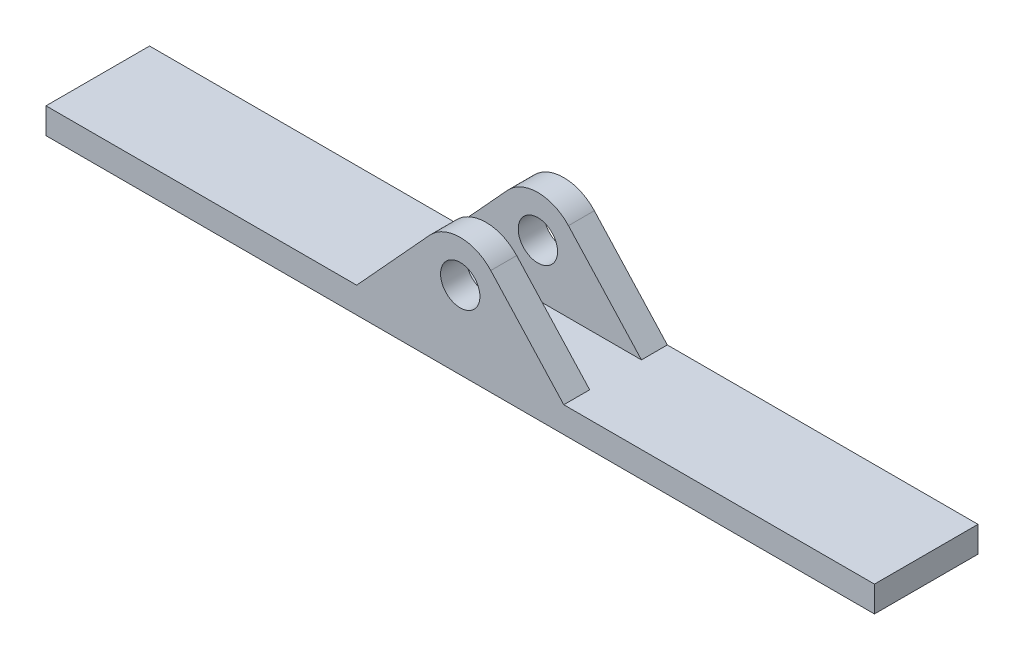
ISO-10303-21;
HEADER;
FILE_DESCRIPTION(('STEP AP214'),'2;1');
FILE_NAME('part.step','',(''),(''),'','','');
FILE_SCHEMA(('AUTOMOTIVE_DESIGN { 1 0 10303 214 1 1 1 1 }'));
ENDSEC;
DATA;
#1=APPLICATION_CONTEXT('core data for automotive mechanical design processes');
#2=APPLICATION_PROTOCOL_DEFINITION('international standard','automotive_design',2000,#1);
#3=PRODUCT_CONTEXT('',#1,'mechanical');
#4=PRODUCT('Part','Part','',(#3));
#5=PRODUCT_RELATED_PRODUCT_CATEGORY('part','',(#4));
#6=PRODUCT_DEFINITION_FORMATION('','',#4);
#7=PRODUCT_DEFINITION_CONTEXT('part definition',#1,'design');
#8=PRODUCT_DEFINITION('design','',#6,#7);
#9=PRODUCT_DEFINITION_SHAPE('','',#8);
#10=(LENGTH_UNIT() NAMED_UNIT(*) SI_UNIT(.MILLI.,.METRE.));
#11=(NAMED_UNIT(*) PLANE_ANGLE_UNIT() SI_UNIT($,.RADIAN.));
#12=(NAMED_UNIT(*) SI_UNIT($,.STERADIAN.) SOLID_ANGLE_UNIT());
#13=UNCERTAINTY_MEASURE_WITH_UNIT(LENGTH_MEASURE(1.E-05),#10,'distance_accuracy_value','');
#14=(GEOMETRIC_REPRESENTATION_CONTEXT(3) GLOBAL_UNCERTAINTY_ASSIGNED_CONTEXT((#13)) GLOBAL_UNIT_ASSIGNED_CONTEXT((#10,
#11,#12)) REPRESENTATION_CONTEXT('',''));
#15=CARTESIAN_POINT('',(0.,0.,0.));
#16=DIRECTION('',(0.,0.,1.));
#17=DIRECTION('',(1.,0.,0.));
#18=AXIS2_PLACEMENT_3D('',#15,#16,#17);
#19=CARTESIAN_POINT('',(-50.8,-6.34999999999978,0.));
#20=DIRECTION('',(0.,0.,1.));
#21=DIRECTION('',(1.,0.,0.));
#22=AXIS2_PLACEMENT_3D('',#19,#20,#21);
#23=PLANE('',#22);
#24=CARTESIAN_POINT('',(0.,0.,0.));
#25=DIRECTION('',(0.,0.,1.));
#26=DIRECTION('',(1.,0.,0.));
#27=AXIS2_PLACEMENT_3D('',#24,#25,#26);
#28=CIRCLE('',#27,2.413);
#29=CARTESIAN_POINT('',(2.413,0.,0.));
#30=VERTEX_POINT('',#29);
#31=EDGE_CURVE('E119',#30,#30,#28,.T.);
#32=ORIENTED_EDGE('',*,*,#31,.T.);
#33=EDGE_LOOP('',(#32));
#34=FACE_BOUND('',#33,.T.);
#35=CARTESIAN_POINT('',(0.,0.,0.));
#36=DIRECTION('',(0.,0.,1.));
#37=DIRECTION('',(1.,0.,0.));
#38=AXIS2_PLACEMENT_3D('',#35,#36,#37);
#39=CIRCLE('',#38,5.08);
#40=CARTESIAN_POINT('',(3.74707028261062,3.43014056522125,0.));
#41=VERTEX_POINT('',#40);
#42=CARTESIAN_POINT('',(-3.74707028261063,3.43014056522125,0.));
#43=VERTEX_POINT('',#42);
#44=EDGE_CURVE('E19',#41,#43,#39,.T.);
#45=ORIENTED_EDGE('',*,*,#44,.F.);
#46=DIRECTION('',(-0.675224520712844,0.737612260356422,0.));
#47=VECTOR('',#46,1.);
#48=CARTESIAN_POINT('',(0.,7.52342346015067,0.));
#49=LINE('',#48,#47);
#50=CARTESIAN_POINT('',(12.7,-6.35,0.));
#51=VERTEX_POINT('',#50);
#52=EDGE_CURVE('E112',#51,#41,#49,.T.);
#53=ORIENTED_EDGE('',*,*,#52,.F.);
#54=DIRECTION('',(-1.,0.,0.));
#55=VECTOR('',#54,1.);
#56=CARTESIAN_POINT('',(12.7,-6.35,0.));
#57=LINE('',#56,#55);
#58=CARTESIAN_POINT('',(-12.7,-6.34999999999995,0.));
#59=VERTEX_POINT('',#58);
#60=EDGE_CURVE('E116',#59,#51,#57,.F.);
#61=ORIENTED_EDGE('',*,*,#60,.F.);
#62=DIRECTION('',(-0.675224520712844,-0.737612260356422,0.));
#63=VECTOR('',#62,1.);
#64=CARTESIAN_POINT('',(-12.7,-6.35,0.));
#65=LINE('',#64,#63);
#66=EDGE_CURVE('E114',#43,#59,#65,.T.);
#67=ORIENTED_EDGE('',*,*,#66,.F.);
#68=EDGE_LOOP('',(#45,#53,#61,#67));
#69=FACE_BOUND('',#68,.T.);
#70=ADVANCED_FACE('F16',(#34,#69),#23,.F.);
#71=CARTESIAN_POINT('',(-50.8,-6.34999999999978,-6.35));
#72=DIRECTION('',(0.,0.,-1.));
#73=DIRECTION('',(-1.,0.,0.));
#74=AXIS2_PLACEMENT_3D('',#71,#72,#73);
#75=PLANE('',#74);
#76=CARTESIAN_POINT('',(0.,0.,-6.35));
#77=DIRECTION('',(0.,0.,1.));
#78=DIRECTION('',(1.,0.,0.));
#79=AXIS2_PLACEMENT_3D('',#76,#77,#78);
#80=CIRCLE('',#79,2.413);
#81=CARTESIAN_POINT('',(2.413,0.,-6.35));
#82=VERTEX_POINT('',#81);
#83=EDGE_CURVE('E153',#82,#82,#80,.F.);
#84=ORIENTED_EDGE('',*,*,#83,.T.);
#85=EDGE_LOOP('',(#84));
#86=FACE_BOUND('',#85,.T.);
#87=CARTESIAN_POINT('',(0.,0.,-6.35));
#88=DIRECTION('',(0.,0.,1.));
#89=DIRECTION('',(1.,0.,0.));
#90=AXIS2_PLACEMENT_3D('',#87,#88,#89);
#91=CIRCLE('',#90,5.08);
#92=CARTESIAN_POINT('',(-3.74707028261063,3.43014056522125,-6.35));
#93=VERTEX_POINT('',#92);
#94=CARTESIAN_POINT('',(3.74707028261063,3.43014056522124,-6.35));
#95=VERTEX_POINT('',#94);
#96=EDGE_CURVE('E191',#93,#95,#91,.F.);
#97=ORIENTED_EDGE('',*,*,#96,.F.);
#98=DIRECTION('',(-0.675224520712844,-0.737612260356422,0.));
#99=VECTOR('',#98,1.);
#100=CARTESIAN_POINT('',(-12.7,-6.35,-6.35));
#101=LINE('',#100,#99);
#102=CARTESIAN_POINT('',(-12.7,-6.35,-6.35));
#103=VERTEX_POINT('',#102);
#104=EDGE_CURVE('E156',#103,#93,#101,.F.);
#105=ORIENTED_EDGE('',*,*,#104,.F.);
#106=DIRECTION('',(-1.,0.,0.));
#107=VECTOR('',#106,1.);
#108=CARTESIAN_POINT('',(12.7,-6.35,-6.35));
#109=LINE('',#108,#107);
#110=CARTESIAN_POINT('',(12.7,-6.34999999999997,-6.35));
#111=VERTEX_POINT('',#110);
#112=EDGE_CURVE('E149',#111,#103,#109,.T.);
#113=ORIENTED_EDGE('',*,*,#112,.F.);
#114=DIRECTION('',(-0.675224520712844,0.737612260356422,0.));
#115=VECTOR('',#114,1.);
#116=CARTESIAN_POINT('',(0.,7.52342346015067,-6.35));
#117=LINE('',#116,#115);
#118=EDGE_CURVE('E134',#95,#111,#117,.F.);
#119=ORIENTED_EDGE('',*,*,#118,.F.);
#120=EDGE_LOOP('',(#97,#105,#113,#119));
#121=FACE_BOUND('',#120,.T.);
#122=ADVANCED_FACE('F342',(#86,#121),#75,.F.);
#123=CARTESIAN_POINT('',(0.,7.52342346015067,-9.525));
#124=DIRECTION('',(0.737612260356422,0.675224520712844,0.));
#125=DIRECTION('',(-0.675224520712844,0.737612260356422,0.));
#126=AXIS2_PLACEMENT_3D('',#123,#124,#125);
#127=PLANE('',#126);
#128=DIRECTION('',(-0.675224520712844,0.737612260356422,0.));
#129=VECTOR('',#128,1.);
#130=CARTESIAN_POINT('',(12.7,-6.35,3.175));
#131=LINE('',#130,#129);
#132=CARTESIAN_POINT('',(12.7,-6.35,3.175));
#133=VERTEX_POINT('',#132);
#134=CARTESIAN_POINT('',(3.74707028261063,3.43014056522124,3.175));
#135=VERTEX_POINT('',#134);
#136=EDGE_CURVE('E190',#133,#135,#131,.T.);
#137=ORIENTED_EDGE('',*,*,#136,.F.);
#138=DIRECTION('',(0.,0.,1.));
#139=VECTOR('',#138,1.);
#140=CARTESIAN_POINT('',(12.7,-6.35,-9.525));
#141=LINE('',#140,#139);
#142=EDGE_CURVE('E131',#51,#133,#141,.T.);
#143=ORIENTED_EDGE('',*,*,#142,.F.);
#144=ORIENTED_EDGE('',*,*,#52,.T.);
#145=DIRECTION('',(0.,0.,1.));
#146=VECTOR('',#145,1.);
#147=CARTESIAN_POINT('',(3.74707028261062,3.43014056522125,-9.525));
#148=LINE('',#147,#146);
#149=EDGE_CURVE('E111',#135,#41,#148,.F.);
#150=ORIENTED_EDGE('',*,*,#149,.F.);
#151=EDGE_LOOP('',(#137,#143,#144,#150));
#152=FACE_BOUND('',#151,.T.);
#153=ADVANCED_FACE('F340',(#152),#127,.T.);
#154=CARTESIAN_POINT('',(0.,0.,-9.525));
#155=DIRECTION('',(0.,0.,1.));
#156=DIRECTION('',(1.,0.,0.));
#157=AXIS2_PLACEMENT_3D('',#154,#155,#156);
#158=CYLINDRICAL_SURFACE('',#157,5.08);
#159=CARTESIAN_POINT('',(0.,0.,3.175));
#160=DIRECTION('',(0.,0.,1.));
#161=DIRECTION('',(1.,0.,0.));
#162=AXIS2_PLACEMENT_3D('',#159,#160,#161);
#163=CIRCLE('',#162,5.08);
#164=CARTESIAN_POINT('',(-3.74707028261063,3.43014056522125,3.175));
#165=VERTEX_POINT('',#164);
#166=EDGE_CURVE('E188',#135,#165,#163,.T.);
#167=ORIENTED_EDGE('',*,*,#166,.F.);
#168=ORIENTED_EDGE('',*,*,#149,.T.);
#169=ORIENTED_EDGE('',*,*,#44,.T.);
#170=DIRECTION('',(0.,0.,1.));
#171=VECTOR('',#170,1.);
#172=CARTESIAN_POINT('',(-3.74707028261062,3.43014056522125,-9.525));
#173=LINE('',#172,#171);
#174=EDGE_CURVE('E109',#165,#43,#173,.F.);
#175=ORIENTED_EDGE('',*,*,#174,.F.);
#176=EDGE_LOOP('',(#167,#168,#169,#175));
#177=FACE_BOUND('',#176,.T.);
#178=ADVANCED_FACE('F107',(#177),#158,.T.);
#179=CARTESIAN_POINT('',(-12.7,-6.35,-9.525));
#180=DIRECTION('',(-0.737612260356422,0.675224520712844,0.));
#181=DIRECTION('',(-0.675224520712844,-0.737612260356422,0.));
#182=AXIS2_PLACEMENT_3D('',#179,#180,#181);
#183=PLANE('',#182);
#184=ORIENTED_EDGE('',*,*,#66,.T.);
#185=DIRECTION('',(0.,0.,1.));
#186=VECTOR('',#185,1.);
#187=CARTESIAN_POINT('',(-12.7,-6.34999999999999,-9.525));
#188=LINE('',#187,#186);
#189=CARTESIAN_POINT('',(-12.7,-6.35,3.175));
#190=VERTEX_POINT('',#189);
#191=EDGE_CURVE('E152',#190,#59,#188,.F.);
#192=ORIENTED_EDGE('',*,*,#191,.F.);
#193=DIRECTION('',(-0.675224520712844,-0.737612260356422,0.));
#194=VECTOR('',#193,1.);
#195=CARTESIAN_POINT('',(-3.74707028261062,3.43014056522125,3.175));
#196=LINE('',#195,#194);
#197=EDGE_CURVE('E123',#165,#190,#196,.T.);
#198=ORIENTED_EDGE('',*,*,#197,.F.);
#199=ORIENTED_EDGE('',*,*,#174,.T.);
#200=EDGE_LOOP('',(#184,#192,#198,#199));
#201=FACE_BOUND('',#200,.T.);
#202=ADVANCED_FACE('F121',(#201),#183,.T.);
#203=CARTESIAN_POINT('',(0.,0.,-9.525));
#204=DIRECTION('',(0.,0.,1.));
#205=DIRECTION('',(1.,0.,0.));
#206=AXIS2_PLACEMENT_3D('',#203,#204,#205);
#207=CYLINDRICAL_SURFACE('',#206,2.413);
#208=CARTESIAN_POINT('',(0.,0.,3.175));
#209=DIRECTION('',(0.,0.,1.));
#210=DIRECTION('',(1.,0.,0.));
#211=AXIS2_PLACEMENT_3D('',#208,#209,#210);
#212=CIRCLE('',#211,2.413);
#213=CARTESIAN_POINT('',(2.413,0.,3.175));
#214=VERTEX_POINT('',#213);
#215=EDGE_CURVE('E140',#214,#214,#212,.F.);
#216=ORIENTED_EDGE('',*,*,#215,.F.);
#217=EDGE_LOOP('',(#216));
#218=FACE_BOUND('',#217,.T.);
#219=ORIENTED_EDGE('',*,*,#31,.F.);
#220=EDGE_LOOP('',(#219));
#221=FACE_BOUND('',#220,.T.);
#222=ADVANCED_FACE('F199',(#218,#221),#207,.F.);
#223=CARTESIAN_POINT('',(0.,0.,-9.525));
#224=DIRECTION('',(0.,0.,1.));
#225=DIRECTION('',(1.,0.,0.));
#226=AXIS2_PLACEMENT_3D('',#223,#224,#225);
#227=CYLINDRICAL_SURFACE('',#226,2.413);
#228=CARTESIAN_POINT('',(0.,0.,-9.525));
#229=DIRECTION('',(0.,0.,1.));
#230=DIRECTION('',(1.,0.,0.));
#231=AXIS2_PLACEMENT_3D('',#228,#229,#230);
#232=CIRCLE('',#231,2.413);
#233=CARTESIAN_POINT('',(2.413,0.,-9.525));
#234=VERTEX_POINT('',#233);
#235=EDGE_CURVE('E180',#234,#234,#232,.F.);
#236=ORIENTED_EDGE('',*,*,#235,.T.);
#237=EDGE_LOOP('',(#236));
#238=FACE_BOUND('',#237,.T.);
#239=ORIENTED_EDGE('',*,*,#83,.F.);
#240=EDGE_LOOP('',(#239));
#241=FACE_BOUND('',#240,.T.);
#242=ADVANCED_FACE('F201',(#238,#241),#227,.F.);
#243=CARTESIAN_POINT('',(12.7,-6.35,-9.525));
#244=DIRECTION('',(0.,1.,0.));
#245=DIRECTION('',(-1.,0.,0.));
#246=AXIS2_PLACEMENT_3D('',#243,#244,#245);
#247=PLANE('',#246);
#248=DIRECTION('',(0.,0.,1.));
#249=VECTOR('',#248,1.);
#250=CARTESIAN_POINT('',(50.8,-6.35,-9.525));
#251=LINE('',#250,#249);
#252=CARTESIAN_POINT('',(50.8,-6.35,-9.525));
#253=VERTEX_POINT('',#252);
#254=CARTESIAN_POINT('',(50.8,-6.35,3.175));
#255=VERTEX_POINT('',#254);
#256=EDGE_CURVE('E254',#253,#255,#251,.T.);
#257=ORIENTED_EDGE('',*,*,#256,.F.);
#258=DIRECTION('',(1.,0.,0.));
#259=VECTOR('',#258,1.);
#260=CARTESIAN_POINT('',(0.,-6.35,-9.525));
#261=LINE('',#260,#259);
#262=CARTESIAN_POINT('',(12.7,-6.34999999999999,-9.525));
#263=VERTEX_POINT('',#262);
#264=EDGE_CURVE('E258',#253,#263,#261,.F.);
#265=ORIENTED_EDGE('',*,*,#264,.T.);
#266=DIRECTION('',(0.,0.,1.));
#267=VECTOR('',#266,1.);
#268=CARTESIAN_POINT('',(12.7,-6.34999999999996,-9.525));
#269=LINE('',#268,#267);
#270=EDGE_CURVE('E165',#111,#263,#269,.F.);
#271=ORIENTED_EDGE('',*,*,#270,.F.);
#272=ORIENTED_EDGE('',*,*,#112,.T.);
#273=DIRECTION('',(0.,0.,1.));
#274=VECTOR('',#273,1.);
#275=CARTESIAN_POINT('',(-12.7,-6.35,-9.525));
#276=LINE('',#275,#274);
#277=CARTESIAN_POINT('',(-12.7,-6.35,-9.525));
#278=VERTEX_POINT('',#277);
#279=EDGE_CURVE('E260',#278,#103,#276,.T.);
#280=ORIENTED_EDGE('',*,*,#279,.F.);
#281=DIRECTION('',(1.,0.,0.));
#282=VECTOR('',#281,1.);
#283=CARTESIAN_POINT('',(0.,-6.35,-9.525));
#284=LINE('',#283,#282);
#285=CARTESIAN_POINT('',(-50.8,-6.35,-9.525));
#286=VERTEX_POINT('',#285);
#287=EDGE_CURVE('E183',#278,#286,#284,.F.);
#288=ORIENTED_EDGE('',*,*,#287,.T.);
#289=DIRECTION('',(0.,0.,1.));
#290=VECTOR('',#289,1.);
#291=CARTESIAN_POINT('',(-50.8,-6.35,-9.525));
#292=LINE('',#291,#290);
#293=CARTESIAN_POINT('',(-50.8,-6.35,3.175));
#294=VERTEX_POINT('',#293);
#295=EDGE_CURVE('E184',#294,#286,#292,.F.);
#296=ORIENTED_EDGE('',*,*,#295,.F.);
#297=DIRECTION('',(1.,0.,0.));
#298=VECTOR('',#297,1.);
#299=CARTESIAN_POINT('',(0.,-6.35,3.175));
#300=LINE('',#299,#298);
#301=EDGE_CURVE('E146',#190,#294,#300,.F.);
#302=ORIENTED_EDGE('',*,*,#301,.F.);
#303=ORIENTED_EDGE('',*,*,#191,.T.);
#304=ORIENTED_EDGE('',*,*,#60,.T.);
#305=ORIENTED_EDGE('',*,*,#142,.T.);
#306=DIRECTION('',(1.,0.,0.));
#307=VECTOR('',#306,1.);
#308=CARTESIAN_POINT('',(0.,-6.35,3.175));
#309=LINE('',#308,#307);
#310=EDGE_CURVE('E137',#255,#133,#309,.F.);
#311=ORIENTED_EDGE('',*,*,#310,.F.);
#312=EDGE_LOOP('',(#257,#265,#271,#272,#280,#288,#296,#302,#303,#304,#305,#311));
#313=FACE_BOUND('',#312,.T.);
#314=ADVANCED_FACE('F209',(#313),#247,.T.);
#315=CARTESIAN_POINT('',(0.,7.52342346015067,-9.525));
#316=DIRECTION('',(0.737612260356422,0.675224520712844,0.));
#317=DIRECTION('',(-0.675224520712844,0.737612260356422,0.));
#318=AXIS2_PLACEMENT_3D('',#315,#316,#317);
#319=PLANE('',#318);
#320=ORIENTED_EDGE('',*,*,#118,.T.);
#321=ORIENTED_EDGE('',*,*,#270,.T.);
#322=DIRECTION('',(-0.675224520712844,0.737612260356422,0.));
#323=VECTOR('',#322,1.);
#324=CARTESIAN_POINT('',(12.7,-6.35,-9.525));
#325=LINE('',#324,#323);
#326=CARTESIAN_POINT('',(3.74707028261063,3.43014056522124,-9.525));
#327=VERTEX_POINT('',#326);
#328=EDGE_CURVE('E179',#263,#327,#325,.T.);
#329=ORIENTED_EDGE('',*,*,#328,.T.);
#330=DIRECTION('',(0.,0.,1.));
#331=VECTOR('',#330,1.);
#332=CARTESIAN_POINT('',(3.74707028261062,3.43014056522124,-9.525));
#333=LINE('',#332,#331);
#334=EDGE_CURVE('E160',#95,#327,#333,.F.);
#335=ORIENTED_EDGE('',*,*,#334,.F.);
#336=EDGE_LOOP('',(#320,#321,#329,#335));
#337=FACE_BOUND('',#336,.T.);
#338=ADVANCED_FACE('F244',(#337),#319,.T.);
#339=CARTESIAN_POINT('',(0.,0.,-9.525));
#340=DIRECTION('',(0.,0.,1.));
#341=DIRECTION('',(1.,0.,0.));
#342=AXIS2_PLACEMENT_3D('',#339,#340,#341);
#343=CYLINDRICAL_SURFACE('',#342,5.08);
#344=ORIENTED_EDGE('',*,*,#96,.T.);
#345=ORIENTED_EDGE('',*,*,#334,.T.);
#346=CARTESIAN_POINT('',(0.,0.,-9.525));
#347=DIRECTION('',(0.,0.,1.));
#348=DIRECTION('',(1.,0.,0.));
#349=AXIS2_PLACEMENT_3D('',#346,#347,#348);
#350=CIRCLE('',#349,5.08);
#351=CARTESIAN_POINT('',(-3.74707028261063,3.43014056522125,-9.525));
#352=VERTEX_POINT('',#351);
#353=EDGE_CURVE('E176',#327,#352,#350,.T.);
#354=ORIENTED_EDGE('',*,*,#353,.T.);
#355=DIRECTION('',(0.,0.,1.));
#356=VECTOR('',#355,1.);
#357=CARTESIAN_POINT('',(-3.74707028261062,3.43014056522125,-9.525));
#358=LINE('',#357,#356);
#359=EDGE_CURVE('E159',#93,#352,#358,.F.);
#360=ORIENTED_EDGE('',*,*,#359,.F.);
#361=EDGE_LOOP('',(#344,#345,#354,#360));
#362=FACE_BOUND('',#361,.T.);
#363=ADVANCED_FACE('F240',(#362),#343,.T.);
#364=CARTESIAN_POINT('',(-12.7,-6.35,-9.525));
#365=DIRECTION('',(-0.737612260356422,0.675224520712844,0.));
#366=DIRECTION('',(-0.675224520712844,-0.737612260356422,0.));
#367=AXIS2_PLACEMENT_3D('',#364,#365,#366);
#368=PLANE('',#367);
#369=DIRECTION('',(-0.675224520712844,-0.737612260356422,0.));
#370=VECTOR('',#369,1.);
#371=CARTESIAN_POINT('',(-3.74707028261062,3.43014056522125,-9.525));
#372=LINE('',#371,#370);
#373=EDGE_CURVE('E178',#352,#278,#372,.T.);
#374=ORIENTED_EDGE('',*,*,#373,.T.);
#375=ORIENTED_EDGE('',*,*,#279,.T.);
#376=ORIENTED_EDGE('',*,*,#104,.T.);
#377=ORIENTED_EDGE('',*,*,#359,.T.);
#378=EDGE_LOOP('',(#374,#375,#376,#377));
#379=FACE_BOUND('',#378,.T.);
#380=ADVANCED_FACE('F236',(#379),#368,.T.);
#381=CARTESIAN_POINT('',(50.8,-9.525,-9.525));
#382=DIRECTION('',(1.,0.,0.));
#383=DIRECTION('',(0.,1.,0.));
#384=AXIS2_PLACEMENT_3D('',#381,#382,#383);
#385=PLANE('',#384);
#386=DIRECTION('',(0.,0.,-1.));
#387=VECTOR('',#386,1.);
#388=CARTESIAN_POINT('',(50.8,-9.525,-9.525));
#389=LINE('',#388,#387);
#390=CARTESIAN_POINT('',(50.8,-9.525,-9.525));
#391=VERTEX_POINT('',#390);
#392=CARTESIAN_POINT('',(50.8,-9.525,3.175));
#393=VERTEX_POINT('',#392);
#394=EDGE_CURVE('E265',#391,#393,#389,.F.);
#395=ORIENTED_EDGE('',*,*,#394,.F.);
#396=DIRECTION('',(0.,1.,0.));
#397=VECTOR('',#396,1.);
#398=CARTESIAN_POINT('',(50.8,0.,-9.525));
#399=LINE('',#398,#397);
#400=EDGE_CURVE('E263',#391,#253,#399,.T.);
#401=ORIENTED_EDGE('',*,*,#400,.T.);
#402=ORIENTED_EDGE('',*,*,#256,.T.);
#403=DIRECTION('',(0.,1.,0.));
#404=VECTOR('',#403,1.);
#405=CARTESIAN_POINT('',(50.8,0.,3.175));
#406=LINE('',#405,#404);
#407=EDGE_CURVE('E141',#393,#255,#406,.T.);
#408=ORIENTED_EDGE('',*,*,#407,.F.);
#409=EDGE_LOOP('',(#395,#401,#402,#408));
#410=FACE_BOUND('',#409,.T.);
#411=ADVANCED_FACE('F232',(#410),#385,.T.);
#412=CARTESIAN_POINT('',(0.,0.,3.175));
#413=DIRECTION('',(0.,0.,1.));
#414=DIRECTION('',(1.,0.,0.));
#415=AXIS2_PLACEMENT_3D('',#412,#413,#414);
#416=PLANE('',#415);
#417=ORIENTED_EDGE('',*,*,#215,.T.);
#418=EDGE_LOOP('',(#417));
#419=FACE_BOUND('',#418,.T.);
#420=ORIENTED_EDGE('',*,*,#407,.T.);
#421=ORIENTED_EDGE('',*,*,#310,.T.);
#422=ORIENTED_EDGE('',*,*,#136,.T.);
#423=ORIENTED_EDGE('',*,*,#166,.T.);
#424=ORIENTED_EDGE('',*,*,#197,.T.);
#425=ORIENTED_EDGE('',*,*,#301,.T.);
#426=DIRECTION('',(0.,1.,0.));
#427=VECTOR('',#426,1.);
#428=CARTESIAN_POINT('',(-50.8,-9.525,3.175));
#429=LINE('',#428,#427);
#430=CARTESIAN_POINT('',(-50.8,-9.525,3.175));
#431=VERTEX_POINT('',#430);
#432=EDGE_CURVE('E187',#431,#294,#429,.T.);
#433=ORIENTED_EDGE('',*,*,#432,.F.);
#434=DIRECTION('',(1.,0.,0.));
#435=VECTOR('',#434,1.);
#436=CARTESIAN_POINT('',(-50.8,-9.525,3.175));
#437=LINE('',#436,#435);
#438=EDGE_CURVE('E283',#393,#431,#437,.F.);
#439=ORIENTED_EDGE('',*,*,#438,.F.);
#440=EDGE_LOOP('',(#420,#421,#422,#423,#424,#425,#433,#439));
#441=FACE_BOUND('',#440,.T.);
#442=ADVANCED_FACE('F229',(#419,#441),#416,.T.);
#443=CARTESIAN_POINT('',(-50.8,-9.525,-9.525));
#444=DIRECTION('',(-1.,0.,0.));
#445=DIRECTION('',(0.,0.,1.));
#446=AXIS2_PLACEMENT_3D('',#443,#444,#445);
#447=PLANE('',#446);
#448=ORIENTED_EDGE('',*,*,#295,.T.);
#449=DIRECTION('',(0.,1.,0.));
#450=VECTOR('',#449,1.);
#451=CARTESIAN_POINT('',(-50.8,0.,-9.525));
#452=LINE('',#451,#450);
#453=CARTESIAN_POINT('',(-50.8,-9.525,-9.525));
#454=VERTEX_POINT('',#453);
#455=EDGE_CURVE('E34',#286,#454,#452,.F.);
#456=ORIENTED_EDGE('',*,*,#455,.T.);
#457=DIRECTION('',(0.,0.,-1.));
#458=VECTOR('',#457,1.);
#459=CARTESIAN_POINT('',(-50.8,-9.525,-9.525));
#460=LINE('',#459,#458);
#461=EDGE_CURVE('E25',#431,#454,#460,.T.);
#462=ORIENTED_EDGE('',*,*,#461,.F.);
#463=ORIENTED_EDGE('',*,*,#432,.T.);
#464=EDGE_LOOP('',(#448,#456,#462,#463));
#465=FACE_BOUND('',#464,.T.);
#466=ADVANCED_FACE('F222',(#465),#447,.T.);
#467=CARTESIAN_POINT('',(0.,0.,-9.525));
#468=DIRECTION('',(0.,0.,1.));
#469=DIRECTION('',(1.,0.,0.));
#470=AXIS2_PLACEMENT_3D('',#467,#468,#469);
#471=PLANE('',#470);
#472=ORIENTED_EDGE('',*,*,#353,.F.);
#473=ORIENTED_EDGE('',*,*,#328,.F.);
#474=ORIENTED_EDGE('',*,*,#264,.F.);
#475=ORIENTED_EDGE('',*,*,#400,.F.);
#476=DIRECTION('',(1.,0.,0.));
#477=VECTOR('',#476,1.);
#478=CARTESIAN_POINT('',(-50.8,-9.525,-9.525));
#479=LINE('',#478,#477);
#480=EDGE_CURVE('E11',#454,#391,#479,.T.);
#481=ORIENTED_EDGE('',*,*,#480,.F.);
#482=ORIENTED_EDGE('',*,*,#455,.F.);
#483=ORIENTED_EDGE('',*,*,#287,.F.);
#484=ORIENTED_EDGE('',*,*,#373,.F.);
#485=EDGE_LOOP('',(#472,#473,#474,#475,#481,#482,#483,#484));
#486=FACE_BOUND('',#485,.T.);
#487=ORIENTED_EDGE('',*,*,#235,.F.);
#488=EDGE_LOOP('',(#487));
#489=FACE_BOUND('',#488,.T.);
#490=ADVANCED_FACE('F216',(#486,#489),#471,.F.);
#491=CARTESIAN_POINT('',(-50.8,-9.525,-9.525));
#492=DIRECTION('',(0.,-1.,0.));
#493=DIRECTION('',(0.,0.,-1.));
#494=AXIS2_PLACEMENT_3D('',#491,#492,#493);
#495=PLANE('',#494);
#496=ORIENTED_EDGE('',*,*,#461,.T.);
#497=ORIENTED_EDGE('',*,*,#480,.T.);
#498=ORIENTED_EDGE('',*,*,#394,.T.);
#499=ORIENTED_EDGE('',*,*,#438,.T.);
#500=EDGE_LOOP('',(#496,#497,#498,#499));
#501=FACE_BOUND('',#500,.T.);
#502=ADVANCED_FACE('F214',(#501),#495,.T.);
#503=CLOSED_SHELL('',(#70,#122,#153,#178,#202,#222,#242,#314,#338,#363,#380,#411,#442,#466,#490,#502));
#504=MANIFOLD_SOLID_BREP('B1',#503);
#505=ADVANCED_BREP_SHAPE_REPRESENTATION('',(#18,#504),#14);
#506=SHAPE_DEFINITION_REPRESENTATION(#9,#505);
ENDSEC;
END-ISO-10303-21;
